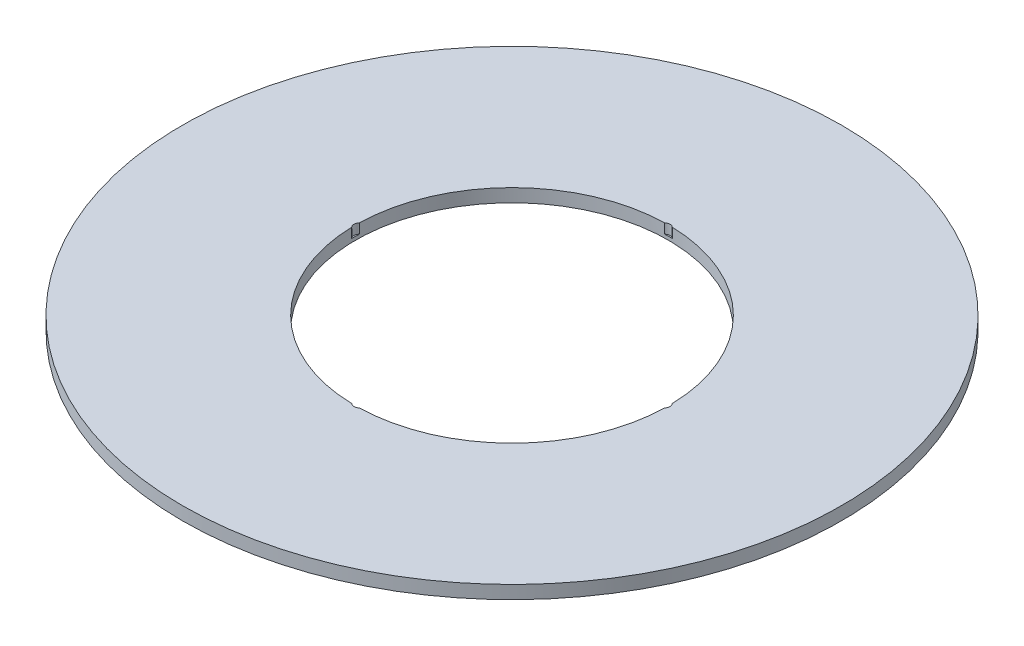
ISO-10303-21;
HEADER;
FILE_DESCRIPTION(('STEP AP214'),'2;1');
FILE_NAME('part.step','',(''),(''),'','','');
FILE_SCHEMA(('AUTOMOTIVE_DESIGN { 1 0 10303 214 1 1 1 1 }'));
ENDSEC;
DATA;
#1=APPLICATION_CONTEXT('core data for automotive mechanical design processes');
#2=APPLICATION_PROTOCOL_DEFINITION('international standard','automotive_design',2000,#1);
#3=PRODUCT_CONTEXT('',#1,'mechanical');
#4=PRODUCT('Part','Part','',(#3));
#5=PRODUCT_RELATED_PRODUCT_CATEGORY('part','',(#4));
#6=PRODUCT_DEFINITION_FORMATION('','',#4);
#7=PRODUCT_DEFINITION_CONTEXT('part definition',#1,'design');
#8=PRODUCT_DEFINITION('design','',#6,#7);
#9=PRODUCT_DEFINITION_SHAPE('','',#8);
#10=(LENGTH_UNIT() NAMED_UNIT(*) SI_UNIT(.MILLI.,.METRE.));
#11=(NAMED_UNIT(*) PLANE_ANGLE_UNIT() SI_UNIT($,.RADIAN.));
#12=(NAMED_UNIT(*) SI_UNIT($,.STERADIAN.) SOLID_ANGLE_UNIT());
#13=UNCERTAINTY_MEASURE_WITH_UNIT(LENGTH_MEASURE(1.E-05),#10,'distance_accuracy_value','');
#14=(GEOMETRIC_REPRESENTATION_CONTEXT(3) GLOBAL_UNCERTAINTY_ASSIGNED_CONTEXT((#13)) GLOBAL_UNIT_ASSIGNED_CONTEXT((#10,
#11,#12)) REPRESENTATION_CONTEXT('',''));
#15=CARTESIAN_POINT('',(0.,0.,0.));
#16=DIRECTION('',(0.,0.,1.));
#17=DIRECTION('',(1.,0.,0.));
#18=AXIS2_PLACEMENT_3D('',#15,#16,#17);
#19=CARTESIAN_POINT('',(0.,4.,0.));
#20=DIRECTION('',(0.,-1.,0.));
#21=DIRECTION('',(0.,0.,-1.));
#22=AXIS2_PLACEMENT_3D('',#19,#20,#21);
#23=CYLINDRICAL_SURFACE('',#22,100.);
#24=CARTESIAN_POINT('',(0.,4.,0.));
#25=DIRECTION('',(0.,1.,0.));
#26=DIRECTION('',(0.,0.,1.));
#27=AXIS2_PLACEMENT_3D('',#24,#25,#26);
#28=CIRCLE('',#27,100.);
#29=CARTESIAN_POINT('',(0.,4.,100.));
#30=VERTEX_POINT('',#29);
#31=EDGE_CURVE('E148',#30,#30,#28,.T.);
#32=ORIENTED_EDGE('',*,*,#31,.F.);
#33=EDGE_LOOP('',(#32));
#34=FACE_BOUND('',#33,.T.);
#35=CARTESIAN_POINT('',(0.,0.,0.));
#36=DIRECTION('',(0.,1.,0.));
#37=DIRECTION('',(0.,0.,1.));
#38=AXIS2_PLACEMENT_3D('',#35,#36,#37);
#39=CIRCLE('',#38,100.);
#40=CARTESIAN_POINT('',(0.,0.,100.));
#41=VERTEX_POINT('',#40);
#42=EDGE_CURVE('E139',#41,#41,#39,.T.);
#43=ORIENTED_EDGE('',*,*,#42,.T.);
#44=EDGE_LOOP('',(#43));
#45=FACE_BOUND('',#44,.T.);
#46=ADVANCED_FACE('F39',(#34,#45),#23,.T.);
#47=CARTESIAN_POINT('',(0.,4.,0.));
#48=DIRECTION('',(0.,1.,0.));
#49=DIRECTION('',(0.,0.,1.));
#50=AXIS2_PLACEMENT_3D('',#47,#48,#49);
#51=PLANE('',#50);
#52=CARTESIAN_POINT('',(1.61602001028097E-13,4.,46.2846526573852));
#53=DIRECTION('',(0.,1.,0.));
#54=DIRECTION('',(1.,0.,0.));
#55=AXIS2_PLACEMENT_3D('',#52,#53,#54);
#56=CIRCLE('',#55,1.65798278879434);
#57=CARTESIAN_POINT('',(-1.14238568262352,4.,47.4862606966703));
#58=VERTEX_POINT('',#57);
#59=CARTESIAN_POINT('',(1.14238568262385,4.,47.4862606966703));
#60=VERTEX_POINT('',#59);
#61=EDGE_CURVE('E175',#58,#60,#56,.T.);
#62=ORIENTED_EDGE('',*,*,#61,.F.);
#63=CARTESIAN_POINT('',(0.,4.,0.));
#64=DIRECTION('',(0.,1.,0.));
#65=DIRECTION('',(0.,0.,1.));
#66=AXIS2_PLACEMENT_3D('',#63,#64,#65);
#67=CIRCLE('',#66,47.5);
#68=CARTESIAN_POINT('',(-47.4862606966703,4.,1.14238568262368));
#69=VERTEX_POINT('',#68);
#70=EDGE_CURVE('E134',#69,#58,#67,.T.);
#71=ORIENTED_EDGE('',*,*,#70,.F.);
#72=CARTESIAN_POINT('',(-46.2846526573852,4.,0.));
#73=DIRECTION('',(0.,1.,0.));
#74=DIRECTION('',(0.,0.,1.));
#75=AXIS2_PLACEMENT_3D('',#72,#73,#74);
#76=CIRCLE('',#75,1.65798278879434);
#77=CARTESIAN_POINT('',(-47.4862606966703,4.,-1.14238568262368));
#78=VERTEX_POINT('',#77);
#79=EDGE_CURVE('E143',#78,#69,#76,.T.);
#80=ORIENTED_EDGE('',*,*,#79,.F.);
#81=CARTESIAN_POINT('',(-1.14238568262418,4.,-47.4862606966703));
#82=VERTEX_POINT('',#81);
#83=EDGE_CURVE('E123',#82,#78,#67,.T.);
#84=ORIENTED_EDGE('',*,*,#83,.F.);
#85=CARTESIAN_POINT('',(-4.8480600308429E-13,4.,-46.2846526573852));
#86=DIRECTION('',(0.,1.,0.));
#87=DIRECTION('',(-1.,0.,0.));
#88=AXIS2_PLACEMENT_3D('',#85,#86,#87);
#89=CIRCLE('',#88,1.65798278879434);
#90=CARTESIAN_POINT('',(1.14238568262318,4.,-47.4862606966703));
#91=VERTEX_POINT('',#90);
#92=EDGE_CURVE('E106',#91,#82,#89,.T.);
#93=ORIENTED_EDGE('',*,*,#92,.F.);
#94=CARTESIAN_POINT('',(47.4862606966703,4.,-1.14238568262368));
#95=VERTEX_POINT('',#94);
#96=EDGE_CURVE('E125',#95,#91,#67,.T.);
#97=ORIENTED_EDGE('',*,*,#96,.F.);
#98=CARTESIAN_POINT('',(46.2846526573852,4.,0.));
#99=DIRECTION('',(0.,1.,0.));
#100=DIRECTION('',(0.,0.,-1.));
#101=AXIS2_PLACEMENT_3D('',#98,#99,#100);
#102=CIRCLE('',#101,1.65798278879434);
#103=CARTESIAN_POINT('',(47.4862606966703,4.,1.14238568262368));
#104=VERTEX_POINT('',#103);
#105=EDGE_CURVE('E286',#104,#95,#102,.T.);
#106=ORIENTED_EDGE('',*,*,#105,.F.);
#107=EDGE_CURVE('E135',#60,#104,#67,.T.);
#108=ORIENTED_EDGE('',*,*,#107,.F.);
#109=EDGE_LOOP('',(#62,#71,#80,#84,#93,#97,#106,#108));
#110=FACE_BOUND('',#109,.T.);
#111=ORIENTED_EDGE('',*,*,#31,.T.);
#112=EDGE_LOOP('',(#111));
#113=FACE_BOUND('',#112,.T.);
#114=ADVANCED_FACE('F118',(#110,#113),#51,.T.);
#115=CARTESIAN_POINT('',(0.,0.,0.));
#116=DIRECTION('',(0.,1.,0.));
#117=DIRECTION('',(0.,0.,1.));
#118=AXIS2_PLACEMENT_3D('',#115,#116,#117);
#119=PLANE('',#118);
#120=CARTESIAN_POINT('',(0.,0.,0.));
#121=DIRECTION('',(0.,1.,0.));
#122=DIRECTION('',(0.,0.,1.));
#123=AXIS2_PLACEMENT_3D('',#120,#121,#122);
#124=CIRCLE('',#123,47.5);
#125=CARTESIAN_POINT('',(0.,0.,47.5));
#126=VERTEX_POINT('',#125);
#127=EDGE_CURVE('E136',#126,#126,#124,.T.);
#128=ORIENTED_EDGE('',*,*,#127,.T.);
#129=EDGE_LOOP('',(#128));
#130=FACE_BOUND('',#129,.T.);
#131=ORIENTED_EDGE('',*,*,#42,.F.);
#132=EDGE_LOOP('',(#131));
#133=FACE_BOUND('',#132,.T.);
#134=ADVANCED_FACE('F187',(#130,#133),#119,.F.);
#135=CARTESIAN_POINT('',(0.,4.,0.));
#136=DIRECTION('',(0.,-1.,0.));
#137=DIRECTION('',(0.,0.,-1.));
#138=AXIS2_PLACEMENT_3D('',#135,#136,#137);
#139=CYLINDRICAL_SURFACE('',#138,47.5);
#140=DIRECTION('',(0.,1.,0.));
#141=VECTOR('',#140,1.);
#142=CARTESIAN_POINT('',(-1.1423856826236,2.51300448893105,47.4862606966703));
#143=LINE('',#142,#141);
#144=CARTESIAN_POINT('',(-1.14238568262352,1.0260089778621,47.4862606966703));
#145=VERTEX_POINT('',#144);
#146=EDGE_CURVE('E11',#145,#58,#143,.T.);
#147=ORIENTED_EDGE('',*,*,#146,.F.);
#148=CARTESIAN_POINT('',(0.,1.0260089778621,0.));
#149=DIRECTION('',(0.,1.,0.));
#150=DIRECTION('',(0.,0.,1.));
#151=AXIS2_PLACEMENT_3D('',#148,#149,#150);
#152=CIRCLE('',#151,47.5);
#153=CARTESIAN_POINT('',(1.14238568262385,1.0260089778621,47.4862606966703));
#154=VERTEX_POINT('',#153);
#155=EDGE_CURVE('E170',#145,#154,#152,.T.);
#156=ORIENTED_EDGE('',*,*,#155,.T.);
#157=DIRECTION('',(0.,1.,0.));
#158=VECTOR('',#157,1.);
#159=CARTESIAN_POINT('',(1.14238568262393,2.51300448893105,47.4862606966703));
#160=LINE('',#159,#158);
#161=EDGE_CURVE('E46',#60,#154,#160,.F.);
#162=ORIENTED_EDGE('',*,*,#161,.F.);
#163=ORIENTED_EDGE('',*,*,#107,.T.);
#164=DIRECTION('',(0.,1.,0.));
#165=VECTOR('',#164,1.);
#166=CARTESIAN_POINT('',(47.4862606966703,2.51300448893105,1.14238568262376));
#167=LINE('',#166,#165);
#168=CARTESIAN_POINT('',(47.4862606966703,1.0260089778621,1.14238568262368));
#169=VERTEX_POINT('',#168);
#170=EDGE_CURVE('E164',#169,#104,#167,.T.);
#171=ORIENTED_EDGE('',*,*,#170,.F.);
#172=CARTESIAN_POINT('',(0.,1.0260089778621,0.));
#173=DIRECTION('',(0.,1.,0.));
#174=DIRECTION('',(0.,0.,1.));
#175=AXIS2_PLACEMENT_3D('',#172,#173,#174);
#176=CIRCLE('',#175,47.5);
#177=CARTESIAN_POINT('',(47.4862606966703,1.0260089778621,-1.14238568262368));
#178=VERTEX_POINT('',#177);
#179=EDGE_CURVE('E115',#169,#178,#176,.T.);
#180=ORIENTED_EDGE('',*,*,#179,.T.);
#181=DIRECTION('',(0.,1.,0.));
#182=VECTOR('',#181,1.);
#183=CARTESIAN_POINT('',(47.4862606966703,2.51300448893105,-1.14238568262376));
#184=LINE('',#183,#182);
#185=EDGE_CURVE('E131',#95,#178,#184,.F.);
#186=ORIENTED_EDGE('',*,*,#185,.F.);
#187=ORIENTED_EDGE('',*,*,#96,.T.);
#188=DIRECTION('',(0.,1.,0.));
#189=VECTOR('',#188,1.);
#190=CARTESIAN_POINT('',(1.14238568262326,2.51300448893105,-47.4862606966703));
#191=LINE('',#190,#189);
#192=CARTESIAN_POINT('',(1.14238568262318,1.0260089778621,-47.4862606966703));
#193=VERTEX_POINT('',#192);
#194=EDGE_CURVE('E105',#193,#91,#191,.T.);
#195=ORIENTED_EDGE('',*,*,#194,.F.);
#196=CARTESIAN_POINT('',(0.,1.0260089778621,0.));
#197=DIRECTION('',(0.,1.,0.));
#198=DIRECTION('',(0.,0.,1.));
#199=AXIS2_PLACEMENT_3D('',#196,#197,#198);
#200=CIRCLE('',#199,47.5);
#201=CARTESIAN_POINT('',(-1.14238568262418,1.0260089778621,-47.4862606966703));
#202=VERTEX_POINT('',#201);
#203=EDGE_CURVE('E159',#193,#202,#200,.T.);
#204=ORIENTED_EDGE('',*,*,#203,.T.);
#205=DIRECTION('',(0.,1.,0.));
#206=VECTOR('',#205,1.);
#207=CARTESIAN_POINT('',(-1.14238568262426,2.51300448893105,-47.4862606966702));
#208=LINE('',#207,#206);
#209=EDGE_CURVE('E114',#82,#202,#208,.F.);
#210=ORIENTED_EDGE('',*,*,#209,.F.);
#211=ORIENTED_EDGE('',*,*,#83,.T.);
#212=DIRECTION('',(0.,1.,0.));
#213=VECTOR('',#212,1.);
#214=CARTESIAN_POINT('',(-47.4862606966703,2.51300448893105,-1.14238568262376));
#215=LINE('',#214,#213);
#216=CARTESIAN_POINT('',(-47.4862606966703,1.0260089778621,-1.14238568262368));
#217=VERTEX_POINT('',#216);
#218=EDGE_CURVE('E160',#217,#78,#215,.T.);
#219=ORIENTED_EDGE('',*,*,#218,.F.);
#220=CARTESIAN_POINT('',(0.,1.0260089778621,0.));
#221=DIRECTION('',(0.,1.,0.));
#222=DIRECTION('',(0.,0.,1.));
#223=AXIS2_PLACEMENT_3D('',#220,#221,#222);
#224=CIRCLE('',#223,47.5);
#225=CARTESIAN_POINT('',(-47.4862606966703,1.0260089778621,1.14238568262368));
#226=VERTEX_POINT('',#225);
#227=EDGE_CURVE('E149',#217,#226,#224,.T.);
#228=ORIENTED_EDGE('',*,*,#227,.T.);
#229=DIRECTION('',(0.,1.,0.));
#230=VECTOR('',#229,1.);
#231=CARTESIAN_POINT('',(-47.4862606966703,2.51300448893105,1.14238568262376));
#232=LINE('',#231,#230);
#233=EDGE_CURVE('E152',#69,#226,#232,.F.);
#234=ORIENTED_EDGE('',*,*,#233,.F.);
#235=ORIENTED_EDGE('',*,*,#70,.T.);
#236=EDGE_LOOP('',(#147,#156,#162,#163,#171,#180,#186,#187,#195,#204,#210,#211,#219,#228,#234,#235));
#237=FACE_BOUND('',#236,.T.);
#238=ORIENTED_EDGE('',*,*,#127,.F.);
#239=EDGE_LOOP('',(#238));
#240=FACE_BOUND('',#239,.T.);
#241=ADVANCED_FACE('F126',(#237,#240),#139,.F.);
#242=CARTESIAN_POINT('',(-46.2846526573852,1.0260089778621,0.));
#243=DIRECTION('',(0.,1.,0.));
#244=DIRECTION('',(0.,0.,1.));
#245=AXIS2_PLACEMENT_3D('',#242,#243,#244);
#246=CYLINDRICAL_SURFACE('',#245,1.65798278879434);
#247=ORIENTED_EDGE('',*,*,#218,.T.);
#248=ORIENTED_EDGE('',*,*,#79,.T.);
#249=ORIENTED_EDGE('',*,*,#233,.T.);
#250=CARTESIAN_POINT('',(-46.2846526573852,1.0260089778621,0.));
#251=DIRECTION('',(0.,1.,0.));
#252=DIRECTION('',(0.,0.,1.));
#253=AXIS2_PLACEMENT_3D('',#250,#251,#252);
#254=CIRCLE('',#253,1.65798278879434);
#255=EDGE_CURVE('E144',#217,#226,#254,.T.);
#256=ORIENTED_EDGE('',*,*,#255,.F.);
#257=EDGE_LOOP('',(#247,#248,#249,#256));
#258=FACE_BOUND('',#257,.T.);
#259=ADVANCED_FACE('F200',(#258),#246,.F.);
#260=CARTESIAN_POINT('',(-46.2846526573852,1.0260089778621,0.));
#261=DIRECTION('',(0.,1.,0.));
#262=DIRECTION('',(0.,0.,1.));
#263=AXIS2_PLACEMENT_3D('',#260,#261,#262);
#264=PLANE('',#263);
#265=ORIENTED_EDGE('',*,*,#255,.T.);
#266=ORIENTED_EDGE('',*,*,#227,.F.);
#267=EDGE_LOOP('',(#265,#266));
#268=FACE_BOUND('',#267,.T.);
#269=ADVANCED_FACE('F201',(#268),#264,.T.);
#270=CARTESIAN_POINT('',(-4.8480600308429E-13,1.0260089778621,-46.2846526573852));
#271=DIRECTION('',(0.,1.,0.));
#272=DIRECTION('',(0.,0.,1.));
#273=AXIS2_PLACEMENT_3D('',#270,#271,#272);
#274=CYLINDRICAL_SURFACE('',#273,1.65798278879434);
#275=ORIENTED_EDGE('',*,*,#194,.T.);
#276=ORIENTED_EDGE('',*,*,#92,.T.);
#277=ORIENTED_EDGE('',*,*,#209,.T.);
#278=CARTESIAN_POINT('',(-4.8480600308429E-13,1.0260089778621,-46.2846526573852));
#279=DIRECTION('',(0.,1.,0.));
#280=DIRECTION('',(-1.,0.,0.));
#281=AXIS2_PLACEMENT_3D('',#278,#279,#280);
#282=CIRCLE('',#281,1.65798278879434);
#283=EDGE_CURVE('E107',#193,#202,#282,.T.);
#284=ORIENTED_EDGE('',*,*,#283,.F.);
#285=EDGE_LOOP('',(#275,#276,#277,#284));
#286=FACE_BOUND('',#285,.T.);
#287=ADVANCED_FACE('F102',(#286),#274,.F.);
#288=CARTESIAN_POINT('',(-4.8480600308429E-13,1.0260089778621,-46.2846526573852));
#289=DIRECTION('',(0.,1.,0.));
#290=DIRECTION('',(-1.,0.,0.));
#291=AXIS2_PLACEMENT_3D('',#288,#289,#290);
#292=PLANE('',#291);
#293=ORIENTED_EDGE('',*,*,#283,.T.);
#294=ORIENTED_EDGE('',*,*,#203,.F.);
#295=EDGE_LOOP('',(#293,#294));
#296=FACE_BOUND('',#295,.T.);
#297=ADVANCED_FACE('F209',(#296),#292,.T.);
#298=CARTESIAN_POINT('',(46.2846526573852,1.0260089778621,0.));
#299=DIRECTION('',(0.,1.,0.));
#300=DIRECTION('',(0.,0.,1.));
#301=AXIS2_PLACEMENT_3D('',#298,#299,#300);
#302=CYLINDRICAL_SURFACE('',#301,1.65798278879434);
#303=ORIENTED_EDGE('',*,*,#170,.T.);
#304=ORIENTED_EDGE('',*,*,#105,.T.);
#305=ORIENTED_EDGE('',*,*,#185,.T.);
#306=CARTESIAN_POINT('',(46.2846526573852,1.0260089778621,0.));
#307=DIRECTION('',(0.,1.,0.));
#308=DIRECTION('',(0.,0.,-1.));
#309=AXIS2_PLACEMENT_3D('',#306,#307,#308);
#310=CIRCLE('',#309,1.65798278879434);
#311=EDGE_CURVE('E56',#169,#178,#310,.T.);
#312=ORIENTED_EDGE('',*,*,#311,.F.);
#313=EDGE_LOOP('',(#303,#304,#305,#312));
#314=FACE_BOUND('',#313,.T.);
#315=ADVANCED_FACE('F213',(#314),#302,.F.);
#316=CARTESIAN_POINT('',(46.2846526573852,1.0260089778621,0.));
#317=DIRECTION('',(0.,1.,0.));
#318=DIRECTION('',(0.,0.,-1.));
#319=AXIS2_PLACEMENT_3D('',#316,#317,#318);
#320=PLANE('',#319);
#321=ORIENTED_EDGE('',*,*,#311,.T.);
#322=ORIENTED_EDGE('',*,*,#179,.F.);
#323=EDGE_LOOP('',(#321,#322));
#324=FACE_BOUND('',#323,.T.);
#325=ADVANCED_FACE('F179',(#324),#320,.T.);
#326=CARTESIAN_POINT('',(1.61602001028097E-13,1.0260089778621,46.2846526573852));
#327=DIRECTION('',(0.,1.,0.));
#328=DIRECTION('',(0.,0.,1.));
#329=AXIS2_PLACEMENT_3D('',#326,#327,#328);
#330=CYLINDRICAL_SURFACE('',#329,1.65798278879434);
#331=ORIENTED_EDGE('',*,*,#146,.T.);
#332=ORIENTED_EDGE('',*,*,#61,.T.);
#333=ORIENTED_EDGE('',*,*,#161,.T.);
#334=CARTESIAN_POINT('',(1.61602001028097E-13,1.0260089778621,46.2846526573852));
#335=DIRECTION('',(0.,1.,0.));
#336=DIRECTION('',(1.,0.,0.));
#337=AXIS2_PLACEMENT_3D('',#334,#335,#336);
#338=CIRCLE('',#337,1.65798278879434);
#339=EDGE_CURVE('E55',#145,#154,#338,.T.);
#340=ORIENTED_EDGE('',*,*,#339,.F.);
#341=EDGE_LOOP('',(#331,#332,#333,#340));
#342=FACE_BOUND('',#341,.T.);
#343=ADVANCED_FACE('F171',(#342),#330,.F.);
#344=CARTESIAN_POINT('',(1.61602001028097E-13,1.0260089778621,46.2846526573852));
#345=DIRECTION('',(0.,1.,0.));
#346=DIRECTION('',(1.,0.,0.));
#347=AXIS2_PLACEMENT_3D('',#344,#345,#346);
#348=PLANE('',#347);
#349=ORIENTED_EDGE('',*,*,#339,.T.);
#350=ORIENTED_EDGE('',*,*,#155,.F.);
#351=EDGE_LOOP('',(#349,#350));
#352=FACE_BOUND('',#351,.T.);
#353=ADVANCED_FACE('F173',(#352),#348,.T.);
#354=CLOSED_SHELL('',(#46,#114,#134,#241,#259,#269,#287,#297,#315,#325,#343,#353));
#355=MANIFOLD_SOLID_BREP('B2',#354);
#356=ADVANCED_BREP_SHAPE_REPRESENTATION('',(#18,#355),#14);
#357=SHAPE_DEFINITION_REPRESENTATION(#9,#356);
ENDSEC;
END-ISO-10303-21;
